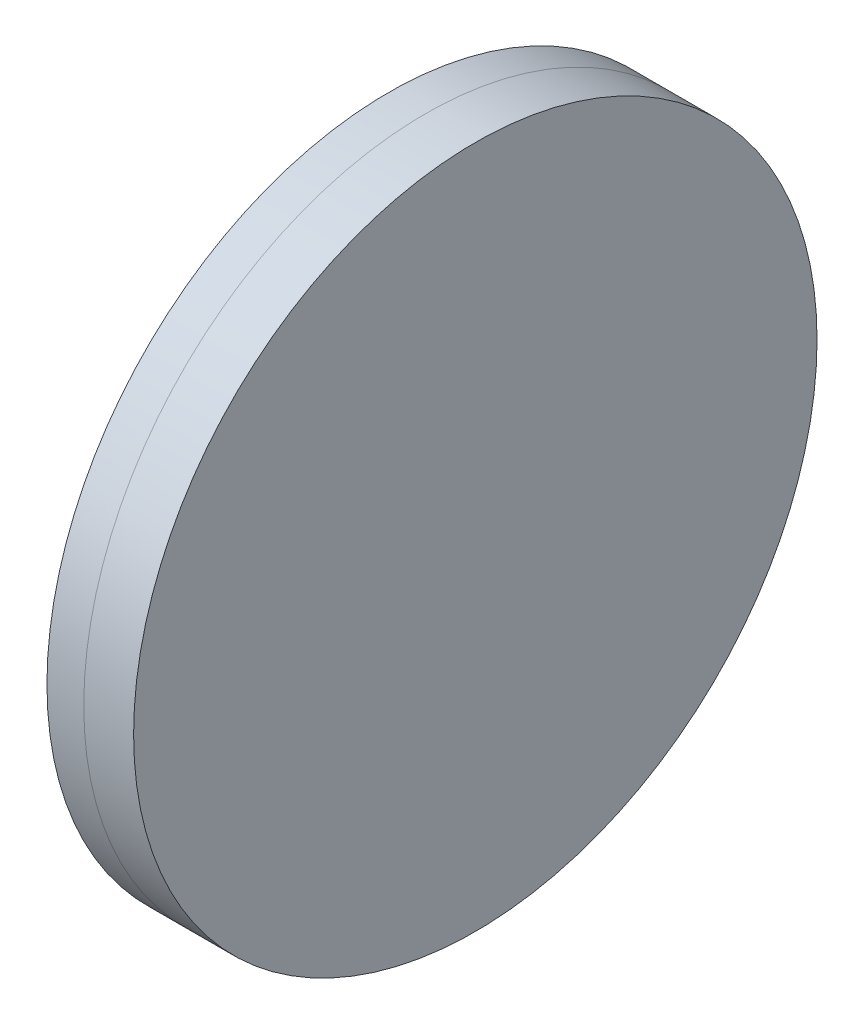
ISO-10303-21;
HEADER;
FILE_DESCRIPTION(('STEP AP214'),'2;1');
FILE_NAME('part.step','',(''),(''),'','','');
FILE_SCHEMA(('AUTOMOTIVE_DESIGN { 1 0 10303 214 1 1 1 1 }'));
ENDSEC;
DATA;
#1=APPLICATION_CONTEXT('core data for automotive mechanical design processes');
#2=APPLICATION_PROTOCOL_DEFINITION('international standard','automotive_design',2000,#1);
#3=PRODUCT_CONTEXT('',#1,'mechanical');
#4=PRODUCT('Part','Part','',(#3));
#5=PRODUCT_RELATED_PRODUCT_CATEGORY('part','',(#4));
#6=PRODUCT_DEFINITION_FORMATION('','',#4);
#7=PRODUCT_DEFINITION_CONTEXT('part definition',#1,'design');
#8=PRODUCT_DEFINITION('design','',#6,#7);
#9=PRODUCT_DEFINITION_SHAPE('','',#8);
#10=(LENGTH_UNIT() NAMED_UNIT(*) SI_UNIT(.MILLI.,.METRE.));
#11=(NAMED_UNIT(*) PLANE_ANGLE_UNIT() SI_UNIT($,.RADIAN.));
#12=(NAMED_UNIT(*) SI_UNIT($,.STERADIAN.) SOLID_ANGLE_UNIT());
#13=UNCERTAINTY_MEASURE_WITH_UNIT(LENGTH_MEASURE(1.E-05),#10,'distance_accuracy_value','');
#14=(GEOMETRIC_REPRESENTATION_CONTEXT(3) GLOBAL_UNCERTAINTY_ASSIGNED_CONTEXT((#13)) GLOBAL_UNIT_ASSIGNED_CONTEXT((#10,
#11,#12)) REPRESENTATION_CONTEXT('',''));
#15=CARTESIAN_POINT('',(0.,0.,0.));
#16=DIRECTION('',(0.,0.,1.));
#17=DIRECTION('',(1.,0.,0.));
#18=AXIS2_PLACEMENT_3D('',#15,#16,#17);
#19=CARTESIAN_POINT('',(-321.350924128296,0.,0.));
#20=DIRECTION('',(-1.,0.,0.));
#21=DIRECTION('',(0.,0.,1.));
#22=AXIS2_PLACEMENT_3D('',#19,#20,#21);
#23=SPHERICAL_SURFACE('',#22,398.1);
#24=CARTESIAN_POINT('',(75.9379506215518,0.,0.));
#25=DIRECTION('',(-1.,0.,0.));
#26=DIRECTION('',(0.,0.,1.));
#27=AXIS2_PLACEMENT_3D('',#24,#25,#26);
#28=CIRCLE('',#27,25.4000000000007);
#29=CARTESIAN_POINT('',(75.9379506215518,0.,25.4000000000007));
#30=VERTEX_POINT('',#29);
#31=EDGE_CURVE('E11',#30,#30,#28,.T.);
#32=ORIENTED_EDGE('',*,*,#31,.T.);
#33=EDGE_LOOP('',(#32));
#34=FACE_BOUND('',#33,.T.);
#35=ADVANCED_FACE('F45',(#34),#23,.F.);
#36=CARTESIAN_POINT('',(-151.128475118145,0.,0.));
#37=DIRECTION('',(-1.,0.,0.));
#38=DIRECTION('',(0.,0.,1.));
#39=AXIS2_PLACEMENT_3D('',#36,#37,#38);
#40=CYLINDRICAL_SURFACE('',#39,25.4000000000006);
#41=CARTESIAN_POINT('',(79.6428504056674,0.,0.));
#42=DIRECTION('',(-1.,0.,0.));
#43=DIRECTION('',(0.,0.,1.));
#44=AXIS2_PLACEMENT_3D('',#41,#42,#43);
#45=CIRCLE('',#44,25.4000000000005);
#46=CARTESIAN_POINT('',(79.6428504056674,0.,25.4000000000005));
#47=VERTEX_POINT('',#46);
#48=EDGE_CURVE('E51',#47,#47,#45,.T.);
#49=ORIENTED_EDGE('',*,*,#48,.T.);
#50=EDGE_LOOP('',(#49));
#51=FACE_BOUND('',#50,.T.);
#52=ORIENTED_EDGE('',*,*,#31,.F.);
#53=EDGE_LOOP('',(#52));
#54=FACE_BOUND('',#53,.T.);
#55=ADVANCED_FACE('F57',(#51,#54),#40,.T.);
#56=CARTESIAN_POINT('',(3519.5490758717,0.,0.));
#57=DIRECTION('',(-1.,0.,0.));
#58=DIRECTION('',(0.,0.,-1.));
#59=AXIS2_PLACEMENT_3D('',#56,#57,#58);
#60=SPHERICAL_SURFACE('',#59,3440.);
#61=ORIENTED_EDGE('',*,*,#48,.F.);
#62=EDGE_LOOP('',(#61));
#63=FACE_BOUND('',#62,.T.);
#64=ADVANCED_FACE('F60',(#63),#60,.F.);
#65=CLOSED_SHELL('',(#35,#55,#64));
#66=MANIFOLD_SOLID_BREP('B2',#65);
#67=CARTESIAN_POINT('',(566.849075871704,0.,0.));
#68=DIRECTION('',(-1.,0.,0.));
#69=DIRECTION('',(0.,0.,1.));
#70=AXIS2_PLACEMENT_3D('',#67,#68,#69);
#71=SPHERICAL_SURFACE('',#70,494.3);
#72=CARTESIAN_POINT('',(73.2021068746284,0.,0.));
#73=DIRECTION('',(-1.,0.,0.));
#74=DIRECTION('',(0.,0.,1.));
#75=AXIS2_PLACEMENT_3D('',#72,#73,#74);
#76=CIRCLE('',#75,25.4);
#77=CARTESIAN_POINT('',(73.2021068746284,0.,25.4));
#78=VERTEX_POINT('',#77);
#79=EDGE_CURVE('E44',#78,#78,#76,.T.);
#80=ORIENTED_EDGE('',*,*,#79,.T.);
#81=EDGE_LOOP('',(#80));
#82=FACE_BOUND('',#81,.T.);
#83=ADVANCED_FACE('F86',(#82),#71,.T.);
#84=CARTESIAN_POINT('',(-402.021265572877,0.,0.));
#85=DIRECTION('',(-1.,0.,0.));
#86=DIRECTION('',(0.,0.,1.));
#87=AXIS2_PLACEMENT_3D('',#84,#85,#86);
#88=CYLINDRICAL_SURFACE('',#87,25.4);
#89=CARTESIAN_POINT('',(75.9379506215518,0.,0.));
#90=DIRECTION('',(-1.,0.,0.));
#91=DIRECTION('',(0.,0.,1.));
#92=AXIS2_PLACEMENT_3D('',#89,#90,#91);
#93=CIRCLE('',#92,25.4);
#94=CARTESIAN_POINT('',(75.9379506215518,0.,25.4));
#95=VERTEX_POINT('',#94);
#96=EDGE_CURVE('E92',#95,#95,#93,.T.);
#97=ORIENTED_EDGE('',*,*,#96,.T.);
#98=EDGE_LOOP('',(#97));
#99=FACE_BOUND('',#98,.T.);
#100=ORIENTED_EDGE('',*,*,#79,.F.);
#101=EDGE_LOOP('',(#100));
#102=FACE_BOUND('',#101,.T.);
#103=ADVANCED_FACE('F98',(#99,#102),#88,.T.);
#104=CARTESIAN_POINT('',(-321.350924128296,0.,0.));
#105=DIRECTION('',(-1.,0.,0.));
#106=DIRECTION('',(0.,0.,1.));
#107=AXIS2_PLACEMENT_3D('',#104,#105,#106);
#108=SPHERICAL_SURFACE('',#107,398.1);
#109=ORIENTED_EDGE('',*,*,#96,.F.);
#110=EDGE_LOOP('',(#109));
#111=FACE_BOUND('',#110,.T.);
#112=ADVANCED_FACE('F101',(#111),#108,.T.);
#113=CLOSED_SHELL('',(#83,#103,#112));
#114=MANIFOLD_SOLID_BREP('B6',#113);
#115=ADVANCED_BREP_SHAPE_REPRESENTATION('',(#18,#66,#114),#14);
#116=SHAPE_DEFINITION_REPRESENTATION(#9,#115);
ENDSEC;
END-ISO-10303-21;
